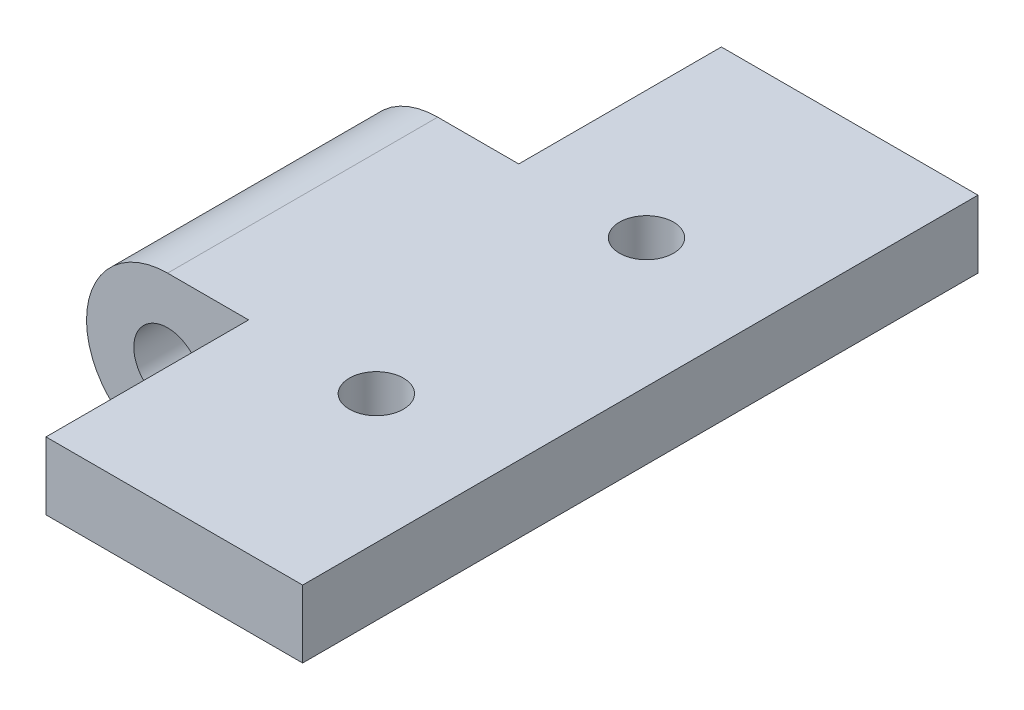
ISO-10303-21;
HEADER;
FILE_DESCRIPTION(('STEP AP214'),'2;1');
FILE_NAME('part.step','',(''),(''),'','','');
FILE_SCHEMA(('AUTOMOTIVE_DESIGN { 1 0 10303 214 1 1 1 1 }'));
ENDSEC;
DATA;
#1=APPLICATION_CONTEXT('core data for automotive mechanical design processes');
#2=APPLICATION_PROTOCOL_DEFINITION('international standard','automotive_design',2000,#1);
#3=PRODUCT_CONTEXT('',#1,'mechanical');
#4=PRODUCT('Part','Part','',(#3));
#5=PRODUCT_RELATED_PRODUCT_CATEGORY('part','',(#4));
#6=PRODUCT_DEFINITION_FORMATION('','',#4);
#7=PRODUCT_DEFINITION_CONTEXT('part definition',#1,'design');
#8=PRODUCT_DEFINITION('design','',#6,#7);
#9=PRODUCT_DEFINITION_SHAPE('','',#8);
#10=(LENGTH_UNIT() NAMED_UNIT(*) SI_UNIT(.MILLI.,.METRE.));
#11=(NAMED_UNIT(*) PLANE_ANGLE_UNIT() SI_UNIT($,.RADIAN.));
#12=(NAMED_UNIT(*) SI_UNIT($,.STERADIAN.) SOLID_ANGLE_UNIT());
#13=UNCERTAINTY_MEASURE_WITH_UNIT(LENGTH_MEASURE(1.E-05),#10,'distance_accuracy_value','');
#14=(GEOMETRIC_REPRESENTATION_CONTEXT(3) GLOBAL_UNCERTAINTY_ASSIGNED_CONTEXT((#13)) GLOBAL_UNIT_ASSIGNED_CONTEXT((#10,
#11,#12)) REPRESENTATION_CONTEXT('',''));
#15=CARTESIAN_POINT('',(0.,0.,0.));
#16=DIRECTION('',(0.,0.,1.));
#17=DIRECTION('',(1.,0.,0.));
#18=AXIS2_PLACEMENT_3D('',#15,#16,#17);
#19=CARTESIAN_POINT('',(6.,-88.6521053852055,35.));
#20=DIRECTION('',(0.,0.,-1.));
#21=DIRECTION('',(-1.,0.,0.));
#22=AXIS2_PLACEMENT_3D('',#19,#20,#21);
#23=PLANE('',#22);
#24=CARTESIAN_POINT('',(0.,0.,35.));
#25=DIRECTION('',(0.,0.,-1.));
#26=DIRECTION('',(-1.,0.,0.));
#27=AXIS2_PLACEMENT_3D('',#24,#25,#26);
#28=CIRCLE('',#27,2.5);
#29=CARTESIAN_POINT('',(-2.5,0.,35.));
#30=VERTEX_POINT('',#29);
#31=EDGE_CURVE('E11',#30,#30,#28,.T.);
#32=ORIENTED_EDGE('',*,*,#31,.T.);
#33=EDGE_LOOP('',(#32));
#34=FACE_BOUND('',#33,.T.);
#35=DIRECTION('',(-1.,0.,0.));
#36=VECTOR('',#35,1.);
#37=CARTESIAN_POINT('',(-25.,6.,35.));
#38=LINE('',#37,#36);
#39=CARTESIAN_POINT('',(6.,6.,35.));
#40=VERTEX_POINT('',#39);
#41=CARTESIAN_POINT('',(0.,6.,35.));
#42=VERTEX_POINT('',#41);
#43=EDGE_CURVE('E47',#40,#42,#38,.T.);
#44=ORIENTED_EDGE('',*,*,#43,.T.);
#45=CARTESIAN_POINT('',(0.,0.,35.));
#46=DIRECTION('',(0.,0.,-1.));
#47=DIRECTION('',(-1.,0.,0.));
#48=AXIS2_PLACEMENT_3D('',#45,#46,#47);
#49=CIRCLE('',#48,6.);
#50=CARTESIAN_POINT('',(5.91607978309962,1.,35.));
#51=VERTEX_POINT('',#50);
#52=EDGE_CURVE('E107',#51,#42,#49,.T.);
#53=ORIENTED_EDGE('',*,*,#52,.F.);
#54=DIRECTION('',(1.,0.,0.));
#55=VECTOR('',#54,1.);
#56=CARTESIAN_POINT('',(-25.,1.,35.));
#57=LINE('',#56,#55);
#58=CARTESIAN_POINT('',(6.,1.,35.));
#59=VERTEX_POINT('',#58);
#60=EDGE_CURVE('E160',#51,#59,#57,.T.);
#61=ORIENTED_EDGE('',*,*,#60,.T.);
#62=DIRECTION('',(0.,1.,0.));
#63=VECTOR('',#62,1.);
#64=CARTESIAN_POINT('',(6.,-88.6521053852055,35.));
#65=LINE('',#64,#63);
#66=EDGE_CURVE('E171',#59,#40,#65,.T.);
#67=ORIENTED_EDGE('',*,*,#66,.T.);
#68=EDGE_LOOP('',(#44,#53,#61,#67));
#69=FACE_BOUND('',#68,.T.);
#70=ADVANCED_FACE('F30',(#34,#69),#23,.F.);
#71=CARTESIAN_POINT('',(-6.,-88.6521053852055,15.));
#72=DIRECTION('',(0.,0.,1.));
#73=DIRECTION('',(1.,0.,0.));
#74=AXIS2_PLACEMENT_3D('',#71,#72,#73);
#75=PLANE('',#74);
#76=CARTESIAN_POINT('',(0.,0.,15.));
#77=DIRECTION('',(0.,0.,1.));
#78=DIRECTION('',(1.,0.,0.));
#79=AXIS2_PLACEMENT_3D('',#76,#77,#78);
#80=CIRCLE('',#79,2.5);
#81=CARTESIAN_POINT('',(2.5,0.,15.));
#82=VERTEX_POINT('',#81);
#83=EDGE_CURVE('E39',#82,#82,#80,.T.);
#84=ORIENTED_EDGE('',*,*,#83,.T.);
#85=EDGE_LOOP('',(#84));
#86=FACE_BOUND('',#85,.T.);
#87=CARTESIAN_POINT('',(0.,0.,15.));
#88=DIRECTION('',(0.,0.,1.));
#89=DIRECTION('',(1.,0.,0.));
#90=AXIS2_PLACEMENT_3D('',#87,#88,#89);
#91=CIRCLE('',#90,6.);
#92=CARTESIAN_POINT('',(0.,6.,15.));
#93=VERTEX_POINT('',#92);
#94=CARTESIAN_POINT('',(5.91607978309962,1.,15.));
#95=VERTEX_POINT('',#94);
#96=EDGE_CURVE('E97',#93,#95,#91,.T.);
#97=ORIENTED_EDGE('',*,*,#96,.F.);
#98=DIRECTION('',(1.,0.,0.));
#99=VECTOR('',#98,1.);
#100=CARTESIAN_POINT('',(-25.,6.,15.));
#101=LINE('',#100,#99);
#102=CARTESIAN_POINT('',(6.,6.,15.));
#103=VERTEX_POINT('',#102);
#104=EDGE_CURVE('E55',#93,#103,#101,.T.);
#105=ORIENTED_EDGE('',*,*,#104,.T.);
#106=DIRECTION('',(0.,1.,0.));
#107=VECTOR('',#106,1.);
#108=CARTESIAN_POINT('',(6.,-88.6521053852055,15.));
#109=LINE('',#108,#107);
#110=CARTESIAN_POINT('',(6.,1.,15.));
#111=VERTEX_POINT('',#110);
#112=EDGE_CURVE('E108',#111,#103,#109,.T.);
#113=ORIENTED_EDGE('',*,*,#112,.F.);
#114=DIRECTION('',(-1.,0.,0.));
#115=VECTOR('',#114,1.);
#116=CARTESIAN_POINT('',(-25.,1.,15.));
#117=LINE('',#116,#115);
#118=EDGE_CURVE('E100',#111,#95,#117,.T.);
#119=ORIENTED_EDGE('',*,*,#118,.T.);
#120=EDGE_LOOP('',(#97,#105,#113,#119));
#121=FACE_BOUND('',#120,.T.);
#122=ADVANCED_FACE('F99',(#86,#121),#75,.F.);
#123=CARTESIAN_POINT('',(-25.,6.,-50.2493781056044));
#124=DIRECTION('',(0.,1.,0.));
#125=DIRECTION('',(0.,0.,1.));
#126=AXIS2_PLACEMENT_3D('',#123,#124,#125);
#127=PLANE('',#126);
#128=CARTESIAN_POINT('',(15.4580398915498,6.,35.));
#129=DIRECTION('',(0.,1.,0.));
#130=DIRECTION('',(0.,0.,1.));
#131=AXIS2_PLACEMENT_3D('',#128,#129,#130);
#132=CIRCLE('',#131,2.);
#133=CARTESIAN_POINT('',(15.4580398915498,6.,37.));
#134=VERTEX_POINT('',#133);
#135=EDGE_CURVE('E127',#134,#134,#132,.F.);
#136=ORIENTED_EDGE('',*,*,#135,.T.);
#137=EDGE_LOOP('',(#136));
#138=FACE_BOUND('',#137,.T.);
#139=CARTESIAN_POINT('',(15.4580398915498,6.,15.));
#140=DIRECTION('',(0.,1.,0.));
#141=DIRECTION('',(0.,0.,1.));
#142=AXIS2_PLACEMENT_3D('',#139,#140,#141);
#143=CIRCLE('',#142,2.);
#144=CARTESIAN_POINT('',(15.4580398915498,6.,17.));
#145=VERTEX_POINT('',#144);
#146=EDGE_CURVE('E123',#145,#145,#143,.F.);
#147=ORIENTED_EDGE('',*,*,#146,.T.);
#148=EDGE_LOOP('',(#147));
#149=FACE_BOUND('',#148,.T.);
#150=ORIENTED_EDGE('',*,*,#104,.F.);
#151=DIRECTION('',(0.,0.,1.));
#152=VECTOR('',#151,1.);
#153=CARTESIAN_POINT('',(0.,6.,-0.001000000000001));
#154=LINE('',#153,#152);
#155=EDGE_CURVE('E106',#93,#42,#154,.T.);
#156=ORIENTED_EDGE('',*,*,#155,.T.);
#157=ORIENTED_EDGE('',*,*,#43,.F.);
#158=DIRECTION('',(0.,0.,-1.));
#159=VECTOR('',#158,1.);
#160=CARTESIAN_POINT('',(6.,6.,-50.2493781056044));
#161=LINE('',#160,#159);
#162=CARTESIAN_POINT('',(6.,6.,50.));
#163=VERTEX_POINT('',#162);
#164=EDGE_CURVE('E120',#163,#40,#161,.T.);
#165=ORIENTED_EDGE('',*,*,#164,.F.);
#166=DIRECTION('',(-1.,0.,0.));
#167=VECTOR('',#166,1.);
#168=CARTESIAN_POINT('',(-25.,6.,50.));
#169=LINE('',#168,#167);
#170=CARTESIAN_POINT('',(25.,6.,50.));
#171=VERTEX_POINT('',#170);
#172=EDGE_CURVE('E146',#171,#163,#169,.T.);
#173=ORIENTED_EDGE('',*,*,#172,.F.);
#174=DIRECTION('',(0.,0.,1.));
#175=VECTOR('',#174,1.);
#176=CARTESIAN_POINT('',(25.,6.,-50.2493781056044));
#177=LINE('',#176,#175);
#178=CARTESIAN_POINT('',(25.,6.,0.));
#179=VERTEX_POINT('',#178);
#180=EDGE_CURVE('E139',#179,#171,#177,.T.);
#181=ORIENTED_EDGE('',*,*,#180,.F.);
#182=DIRECTION('',(1.,0.,0.));
#183=VECTOR('',#182,1.);
#184=CARTESIAN_POINT('',(-25.,6.,0.));
#185=LINE('',#184,#183);
#186=CARTESIAN_POINT('',(6.,6.,0.));
#187=VERTEX_POINT('',#186);
#188=EDGE_CURVE('E138',#187,#179,#185,.T.);
#189=ORIENTED_EDGE('',*,*,#188,.F.);
#190=DIRECTION('',(0.,0.,-1.));
#191=VECTOR('',#190,1.);
#192=CARTESIAN_POINT('',(6.,6.,-50.2493781056044));
#193=LINE('',#192,#191);
#194=EDGE_CURVE('E104',#103,#187,#193,.T.);
#195=ORIENTED_EDGE('',*,*,#194,.F.);
#196=EDGE_LOOP('',(#150,#156,#157,#165,#173,#181,#189,#195));
#197=FACE_BOUND('',#196,.T.);
#198=ADVANCED_FACE('F110',(#138,#149,#197),#127,.T.);
#199=CARTESIAN_POINT('',(6.,-88.6521053852055,50.));
#200=DIRECTION('',(1.,0.,0.));
#201=DIRECTION('',(0.,0.,-1.));
#202=AXIS2_PLACEMENT_3D('',#199,#200,#201);
#203=PLANE('',#202);
#204=DIRECTION('',(0.,1.,0.));
#205=VECTOR('',#204,1.);
#206=CARTESIAN_POINT('',(6.,-88.6521053852055,50.));
#207=LINE('',#206,#205);
#208=CARTESIAN_POINT('',(6.,1.,50.));
#209=VERTEX_POINT('',#208);
#210=EDGE_CURVE('E170',#209,#163,#207,.T.);
#211=ORIENTED_EDGE('',*,*,#210,.T.);
#212=ORIENTED_EDGE('',*,*,#164,.T.);
#213=ORIENTED_EDGE('',*,*,#66,.F.);
#214=DIRECTION('',(0.,0.,1.));
#215=VECTOR('',#214,1.);
#216=CARTESIAN_POINT('',(6.,1.,-50.2493781056044));
#217=LINE('',#216,#215);
#218=EDGE_CURVE('E34',#59,#209,#217,.T.);
#219=ORIENTED_EDGE('',*,*,#218,.T.);
#220=EDGE_LOOP('',(#211,#212,#213,#219));
#221=FACE_BOUND('',#220,.T.);
#222=ADVANCED_FACE('F169',(#221),#203,.F.);
#223=CARTESIAN_POINT('',(6.,-88.6521053852055,15.));
#224=DIRECTION('',(1.,0.,0.));
#225=DIRECTION('',(0.,0.,-1.));
#226=AXIS2_PLACEMENT_3D('',#223,#224,#225);
#227=PLANE('',#226);
#228=ORIENTED_EDGE('',*,*,#112,.T.);
#229=ORIENTED_EDGE('',*,*,#194,.T.);
#230=DIRECTION('',(0.,1.,0.));
#231=VECTOR('',#230,1.);
#232=CARTESIAN_POINT('',(6.,-88.6521053852055,0.));
#233=LINE('',#232,#231);
#234=CARTESIAN_POINT('',(6.,1.,0.));
#235=VERTEX_POINT('',#234);
#236=EDGE_CURVE('E183',#235,#187,#233,.T.);
#237=ORIENTED_EDGE('',*,*,#236,.F.);
#238=DIRECTION('',(0.,0.,1.));
#239=VECTOR('',#238,1.);
#240=CARTESIAN_POINT('',(6.,1.,-50.2493781056044));
#241=LINE('',#240,#239);
#242=EDGE_CURVE('E157',#235,#111,#241,.T.);
#243=ORIENTED_EDGE('',*,*,#242,.T.);
#244=EDGE_LOOP('',(#228,#229,#237,#243));
#245=FACE_BOUND('',#244,.T.);
#246=ADVANCED_FACE('F193',(#245),#227,.F.);
#247=CARTESIAN_POINT('',(15.4580398915498,6.001,35.));
#248=DIRECTION('',(0.,-1.,0.));
#249=DIRECTION('',(0.,0.,-1.));
#250=AXIS2_PLACEMENT_3D('',#247,#248,#249);
#251=CYLINDRICAL_SURFACE('',#250,2.);
#252=ORIENTED_EDGE('',*,*,#135,.F.);
#253=EDGE_LOOP('',(#252));
#254=FACE_BOUND('',#253,.T.);
#255=CARTESIAN_POINT('',(15.4580398915498,1.,35.));
#256=DIRECTION('',(0.,-1.,0.));
#257=DIRECTION('',(0.,0.,-1.));
#258=AXIS2_PLACEMENT_3D('',#255,#256,#257);
#259=CIRCLE('',#258,2.);
#260=CARTESIAN_POINT('',(15.4580398915498,1.,33.));
#261=VERTEX_POINT('',#260);
#262=EDGE_CURVE('E130',#261,#261,#259,.T.);
#263=ORIENTED_EDGE('',*,*,#262,.T.);
#264=EDGE_LOOP('',(#263));
#265=FACE_BOUND('',#264,.T.);
#266=ADVANCED_FACE('F195',(#254,#265),#251,.F.);
#267=CARTESIAN_POINT('',(15.4580398915498,6.001,15.));
#268=DIRECTION('',(0.,-1.,0.));
#269=DIRECTION('',(0.,0.,-1.));
#270=AXIS2_PLACEMENT_3D('',#267,#268,#269);
#271=CYLINDRICAL_SURFACE('',#270,2.);
#272=ORIENTED_EDGE('',*,*,#146,.F.);
#273=EDGE_LOOP('',(#272));
#274=FACE_BOUND('',#273,.T.);
#275=CARTESIAN_POINT('',(15.4580398915498,1.,15.));
#276=DIRECTION('',(0.,-1.,0.));
#277=DIRECTION('',(0.,0.,-1.));
#278=AXIS2_PLACEMENT_3D('',#275,#276,#277);
#279=CIRCLE('',#278,2.);
#280=CARTESIAN_POINT('',(15.4580398915498,1.,13.));
#281=VERTEX_POINT('',#280);
#282=EDGE_CURVE('E124',#281,#281,#279,.T.);
#283=ORIENTED_EDGE('',*,*,#282,.T.);
#284=EDGE_LOOP('',(#283));
#285=FACE_BOUND('',#284,.T.);
#286=ADVANCED_FACE('F201',(#274,#285),#271,.F.);
#287=CARTESIAN_POINT('',(25.,6.,-50.2493781056044));
#288=DIRECTION('',(1.,0.,0.));
#289=DIRECTION('',(0.,0.,-1.));
#290=AXIS2_PLACEMENT_3D('',#287,#288,#289);
#291=PLANE('',#290);
#292=DIRECTION('',(0.,-1.,0.));
#293=VECTOR('',#292,1.);
#294=CARTESIAN_POINT('',(25.,6.,0.));
#295=LINE('',#294,#293);
#296=CARTESIAN_POINT('',(25.,1.,0.));
#297=VERTEX_POINT('',#296);
#298=EDGE_CURVE('E136',#179,#297,#295,.T.);
#299=ORIENTED_EDGE('',*,*,#298,.F.);
#300=ORIENTED_EDGE('',*,*,#180,.T.);
#301=DIRECTION('',(0.,1.,0.));
#302=VECTOR('',#301,1.);
#303=CARTESIAN_POINT('',(25.,6.,50.));
#304=LINE('',#303,#302);
#305=CARTESIAN_POINT('',(25.,1.,50.));
#306=VERTEX_POINT('',#305);
#307=EDGE_CURVE('E143',#306,#171,#304,.T.);
#308=ORIENTED_EDGE('',*,*,#307,.F.);
#309=DIRECTION('',(0.,0.,1.));
#310=VECTOR('',#309,1.);
#311=CARTESIAN_POINT('',(25.,1.,-50.2493781056044));
#312=LINE('',#311,#310);
#313=EDGE_CURVE('E149',#297,#306,#312,.T.);
#314=ORIENTED_EDGE('',*,*,#313,.F.);
#315=EDGE_LOOP('',(#299,#300,#308,#314));
#316=FACE_BOUND('',#315,.T.);
#317=ADVANCED_FACE('F218',(#316),#291,.T.);
#318=CARTESIAN_POINT('',(-25.,1.,-50.2493781056044));
#319=DIRECTION('',(0.,-1.,0.));
#320=DIRECTION('',(0.,0.,-1.));
#321=AXIS2_PLACEMENT_3D('',#318,#319,#320);
#322=PLANE('',#321);
#323=ORIENTED_EDGE('',*,*,#218,.F.);
#324=ORIENTED_EDGE('',*,*,#60,.F.);
#325=DIRECTION('',(0.,0.,-1.));
#326=VECTOR('',#325,1.);
#327=CARTESIAN_POINT('',(5.91607978309962,1.,50.));
#328=LINE('',#327,#326);
#329=EDGE_CURVE('E155',#95,#51,#328,.F.);
#330=ORIENTED_EDGE('',*,*,#329,.F.);
#331=ORIENTED_EDGE('',*,*,#118,.F.);
#332=ORIENTED_EDGE('',*,*,#242,.F.);
#333=DIRECTION('',(-1.,0.,0.));
#334=VECTOR('',#333,1.);
#335=CARTESIAN_POINT('',(-25.,1.,0.));
#336=LINE('',#335,#334);
#337=EDGE_CURVE('E141',#297,#235,#336,.T.);
#338=ORIENTED_EDGE('',*,*,#337,.F.);
#339=ORIENTED_EDGE('',*,*,#313,.T.);
#340=DIRECTION('',(1.,0.,0.));
#341=VECTOR('',#340,1.);
#342=CARTESIAN_POINT('',(-25.,1.,50.));
#343=LINE('',#342,#341);
#344=EDGE_CURVE('E133',#209,#306,#343,.T.);
#345=ORIENTED_EDGE('',*,*,#344,.F.);
#346=EDGE_LOOP('',(#323,#324,#330,#331,#332,#338,#339,#345));
#347=FACE_BOUND('',#346,.T.);
#348=ORIENTED_EDGE('',*,*,#282,.F.);
#349=EDGE_LOOP('',(#348));
#350=FACE_BOUND('',#349,.T.);
#351=ORIENTED_EDGE('',*,*,#262,.F.);
#352=EDGE_LOOP('',(#351));
#353=FACE_BOUND('',#352,.T.);
#354=ADVANCED_FACE('F174',(#347,#350,#353),#322,.T.);
#355=CARTESIAN_POINT('',(0.,0.,50.));
#356=DIRECTION('',(0.,0.,-1.));
#357=DIRECTION('',(-1.,0.,0.));
#358=AXIS2_PLACEMENT_3D('',#355,#356,#357);
#359=CYLINDRICAL_SURFACE('',#358,6.);
#360=ORIENTED_EDGE('',*,*,#329,.T.);
#361=ORIENTED_EDGE('',*,*,#52,.T.);
#362=ORIENTED_EDGE('',*,*,#155,.F.);
#363=ORIENTED_EDGE('',*,*,#96,.T.);
#364=EDGE_LOOP('',(#360,#361,#362,#363));
#365=FACE_BOUND('',#364,.T.);
#366=ADVANCED_FACE('F32',(#365),#359,.T.);
#367=CARTESIAN_POINT('',(0.,0.,0.));
#368=DIRECTION('',(0.,0.,1.));
#369=DIRECTION('',(1.,0.,0.));
#370=AXIS2_PLACEMENT_3D('',#367,#368,#369);
#371=PLANE('',#370);
#372=ORIENTED_EDGE('',*,*,#337,.T.);
#373=ORIENTED_EDGE('',*,*,#236,.T.);
#374=ORIENTED_EDGE('',*,*,#188,.T.);
#375=ORIENTED_EDGE('',*,*,#298,.T.);
#376=EDGE_LOOP('',(#372,#373,#374,#375));
#377=FACE_BOUND('',#376,.T.);
#378=ADVANCED_FACE('F189',(#377),#371,.F.);
#379=CARTESIAN_POINT('',(0.,0.,50.));
#380=DIRECTION('',(0.,0.,1.));
#381=DIRECTION('',(1.,0.,0.));
#382=AXIS2_PLACEMENT_3D('',#379,#380,#381);
#383=PLANE('',#382);
#384=ORIENTED_EDGE('',*,*,#210,.F.);
#385=ORIENTED_EDGE('',*,*,#344,.T.);
#386=ORIENTED_EDGE('',*,*,#307,.T.);
#387=ORIENTED_EDGE('',*,*,#172,.T.);
#388=EDGE_LOOP('',(#384,#385,#386,#387));
#389=FACE_BOUND('',#388,.T.);
#390=ADVANCED_FACE('F180',(#389),#383,.T.);
#391=CARTESIAN_POINT('',(0.,0.,50.));
#392=DIRECTION('',(0.,0.,-1.));
#393=DIRECTION('',(-1.,0.,0.));
#394=AXIS2_PLACEMENT_3D('',#391,#392,#393);
#395=CYLINDRICAL_SURFACE('',#394,2.5);
#396=ORIENTED_EDGE('',*,*,#31,.F.);
#397=EDGE_LOOP('',(#396));
#398=FACE_BOUND('',#397,.T.);
#399=ORIENTED_EDGE('',*,*,#83,.F.);
#400=EDGE_LOOP('',(#399));
#401=FACE_BOUND('',#400,.T.);
#402=ADVANCED_FACE('F226',(#398,#401),#395,.F.);
#403=CLOSED_SHELL('',(#70,#122,#198,#222,#246,#266,#286,#317,#354,#366,#378,#390,#402));
#404=MANIFOLD_SOLID_BREP('B2',#403);
#405=ADVANCED_BREP_SHAPE_REPRESENTATION('',(#18,#404),#14);
#406=SHAPE_DEFINITION_REPRESENTATION(#9,#405);
ENDSEC;
END-ISO-10303-21;
